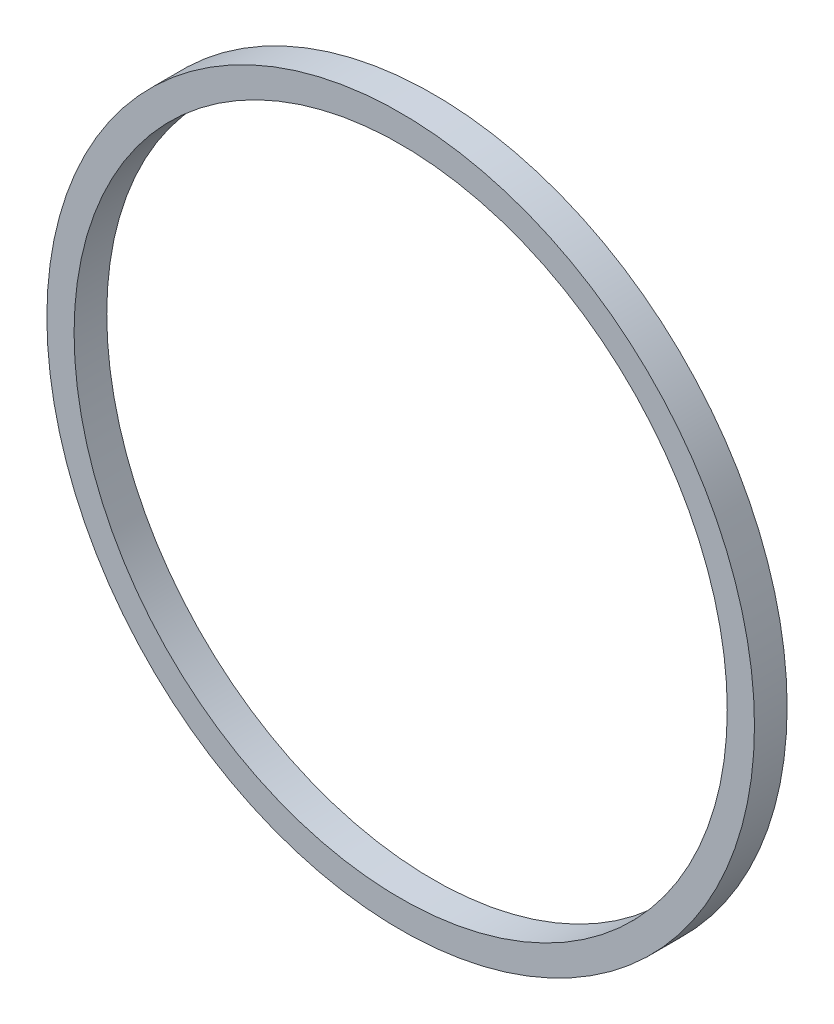
ISO-10303-21;
HEADER;
FILE_DESCRIPTION(('STEP AP214'),'2;1');
FILE_NAME('part.step','',(''),(''),'','','');
FILE_SCHEMA(('AUTOMOTIVE_DESIGN { 1 0 10303 214 1 1 1 1 }'));
ENDSEC;
DATA;
#1=APPLICATION_CONTEXT('core data for automotive mechanical design processes');
#2=APPLICATION_PROTOCOL_DEFINITION('international standard','automotive_design',2000,#1);
#3=PRODUCT_CONTEXT('',#1,'mechanical');
#4=PRODUCT('Part','Part','',(#3));
#5=PRODUCT_RELATED_PRODUCT_CATEGORY('part','',(#4));
#6=PRODUCT_DEFINITION_FORMATION('','',#4);
#7=PRODUCT_DEFINITION_CONTEXT('part definition',#1,'design');
#8=PRODUCT_DEFINITION('design','',#6,#7);
#9=PRODUCT_DEFINITION_SHAPE('','',#8);
#10=(LENGTH_UNIT() NAMED_UNIT(*) SI_UNIT(.MILLI.,.METRE.));
#11=(NAMED_UNIT(*) PLANE_ANGLE_UNIT() SI_UNIT($,.RADIAN.));
#12=(NAMED_UNIT(*) SI_UNIT($,.STERADIAN.) SOLID_ANGLE_UNIT());
#13=UNCERTAINTY_MEASURE_WITH_UNIT(LENGTH_MEASURE(1.E-05),#10,'distance_accuracy_value','');
#14=(GEOMETRIC_REPRESENTATION_CONTEXT(3) GLOBAL_UNCERTAINTY_ASSIGNED_CONTEXT((#13)) GLOBAL_UNIT_ASSIGNED_CONTEXT((#10,
#11,#12)) REPRESENTATION_CONTEXT('',''));
#15=CARTESIAN_POINT('',(0.,0.,0.));
#16=DIRECTION('',(0.,0.,1.));
#17=DIRECTION('',(1.,0.,0.));
#18=AXIS2_PLACEMENT_3D('',#15,#16,#17);
#19=CARTESIAN_POINT('',(0.,0.,6.));
#20=DIRECTION('',(0.,0.,-1.));
#21=DIRECTION('',(-1.,0.,0.));
#22=AXIS2_PLACEMENT_3D('',#19,#20,#21);
#23=CYLINDRICAL_SURFACE('',#22,65.);
#24=CARTESIAN_POINT('',(0.,0.,6.));
#25=DIRECTION('',(0.,0.,1.));
#26=DIRECTION('',(1.,0.,0.));
#27=AXIS2_PLACEMENT_3D('',#24,#25,#26);
#28=CIRCLE('',#27,65.);
#29=CARTESIAN_POINT('',(65.,0.,6.));
#30=VERTEX_POINT('',#29);
#31=EDGE_CURVE('E10',#30,#30,#28,.T.);
#32=ORIENTED_EDGE('',*,*,#31,.F.);
#33=EDGE_LOOP('',(#32));
#34=FACE_BOUND('',#33,.T.);
#35=CARTESIAN_POINT('',(0.,0.,0.));
#36=DIRECTION('',(0.,0.,1.));
#37=DIRECTION('',(1.,0.,0.));
#38=AXIS2_PLACEMENT_3D('',#35,#36,#37);
#39=CIRCLE('',#38,65.);
#40=CARTESIAN_POINT('',(65.,0.,0.));
#41=VERTEX_POINT('',#40);
#42=EDGE_CURVE('E34',#41,#41,#39,.T.);
#43=ORIENTED_EDGE('',*,*,#42,.T.);
#44=EDGE_LOOP('',(#43));
#45=FACE_BOUND('',#44,.T.);
#46=ADVANCED_FACE('F31',(#34,#45),#23,.T.);
#47=CARTESIAN_POINT('',(0.,0.,6.));
#48=DIRECTION('',(0.,0.,1.));
#49=DIRECTION('',(1.,0.,0.));
#50=AXIS2_PLACEMENT_3D('',#47,#48,#49);
#51=PLANE('',#50);
#52=CARTESIAN_POINT('',(0.,0.,6.));
#53=DIRECTION('',(0.,0.,-1.));
#54=DIRECTION('',(-1.,0.,0.));
#55=AXIS2_PLACEMENT_3D('',#52,#53,#54);
#56=CIRCLE('',#55,60.);
#57=CARTESIAN_POINT('',(-60.,0.,6.));
#58=VERTEX_POINT('',#57);
#59=EDGE_CURVE('E41',#58,#58,#56,.T.);
#60=ORIENTED_EDGE('',*,*,#59,.T.);
#61=EDGE_LOOP('',(#60));
#62=FACE_BOUND('',#61,.T.);
#63=ORIENTED_EDGE('',*,*,#31,.T.);
#64=EDGE_LOOP('',(#63));
#65=FACE_BOUND('',#64,.T.);
#66=ADVANCED_FACE('F49',(#62,#65),#51,.T.);
#67=CARTESIAN_POINT('',(0.,0.,0.));
#68=DIRECTION('',(0.,0.,1.));
#69=DIRECTION('',(1.,0.,0.));
#70=AXIS2_PLACEMENT_3D('',#67,#68,#69);
#71=PLANE('',#70);
#72=CARTESIAN_POINT('',(0.,0.,0.));
#73=DIRECTION('',(0.,0.,-1.));
#74=DIRECTION('',(-1.,0.,0.));
#75=AXIS2_PLACEMENT_3D('',#72,#73,#74);
#76=CIRCLE('',#75,60.);
#77=CARTESIAN_POINT('',(-60.,0.,0.));
#78=VERTEX_POINT('',#77);
#79=EDGE_CURVE('E43',#78,#78,#76,.T.);
#80=ORIENTED_EDGE('',*,*,#79,.F.);
#81=EDGE_LOOP('',(#80));
#82=FACE_BOUND('',#81,.T.);
#83=ORIENTED_EDGE('',*,*,#42,.F.);
#84=EDGE_LOOP('',(#83));
#85=FACE_BOUND('',#84,.T.);
#86=ADVANCED_FACE('F54',(#82,#85),#71,.F.);
#87=CARTESIAN_POINT('',(0.,0.,6.));
#88=DIRECTION('',(0.,0.,-1.));
#89=DIRECTION('',(-1.,0.,0.));
#90=AXIS2_PLACEMENT_3D('',#87,#88,#89);
#91=CYLINDRICAL_SURFACE('',#90,60.);
#92=ORIENTED_EDGE('',*,*,#59,.F.);
#93=EDGE_LOOP('',(#92));
#94=FACE_BOUND('',#93,.T.);
#95=ORIENTED_EDGE('',*,*,#79,.T.);
#96=EDGE_LOOP('',(#95));
#97=FACE_BOUND('',#96,.T.);
#98=ADVANCED_FACE('F51',(#94,#97),#91,.F.);
#99=CLOSED_SHELL('',(#46,#66,#86,#98));
#100=MANIFOLD_SOLID_BREP('B2',#99);
#101=ADVANCED_BREP_SHAPE_REPRESENTATION('',(#18,#100),#14);
#102=SHAPE_DEFINITION_REPRESENTATION(#9,#101);
ENDSEC;
END-ISO-10303-21;
